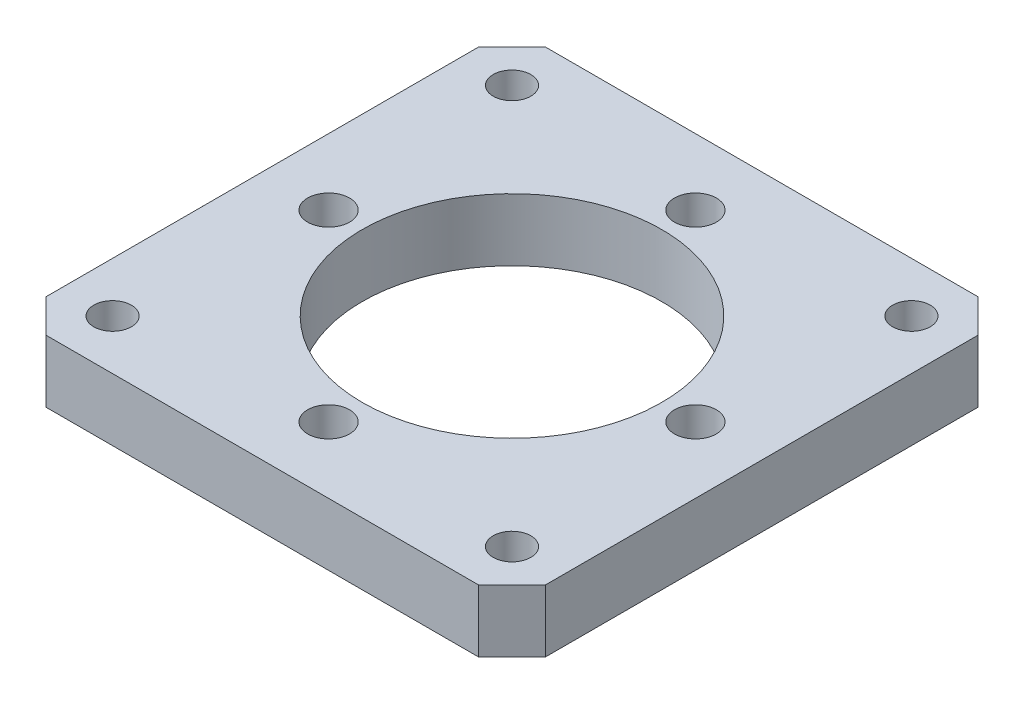
ISO-10303-21;
HEADER;
FILE_DESCRIPTION(('STEP AP214'),'2;1');
FILE_NAME('part.step','',(''),(''),'','','');
FILE_SCHEMA(('AUTOMOTIVE_DESIGN { 1 0 10303 214 1 1 1 1 }'));
ENDSEC;
DATA;
#1=APPLICATION_CONTEXT('core data for automotive mechanical design processes');
#2=APPLICATION_PROTOCOL_DEFINITION('international standard','automotive_design',2000,#1);
#3=PRODUCT_CONTEXT('',#1,'mechanical');
#4=PRODUCT('Part','Part','',(#3));
#5=PRODUCT_RELATED_PRODUCT_CATEGORY('part','',(#4));
#6=PRODUCT_DEFINITION_FORMATION('','',#4);
#7=PRODUCT_DEFINITION_CONTEXT('part definition',#1,'design');
#8=PRODUCT_DEFINITION('design','',#6,#7);
#9=PRODUCT_DEFINITION_SHAPE('','',#8);
#10=(LENGTH_UNIT() NAMED_UNIT(*) SI_UNIT(.MILLI.,.METRE.));
#11=(NAMED_UNIT(*) PLANE_ANGLE_UNIT() SI_UNIT($,.RADIAN.));
#12=(NAMED_UNIT(*) SI_UNIT($,.STERADIAN.) SOLID_ANGLE_UNIT());
#13=UNCERTAINTY_MEASURE_WITH_UNIT(LENGTH_MEASURE(1.E-05),#10,'distance_accuracy_value','');
#14=(GEOMETRIC_REPRESENTATION_CONTEXT(3) GLOBAL_UNCERTAINTY_ASSIGNED_CONTEXT((#13)) GLOBAL_UNIT_ASSIGNED_CONTEXT((#10,
#11,#12)) REPRESENTATION_CONTEXT('',''));
#15=CARTESIAN_POINT('',(0.,0.,0.));
#16=DIRECTION('',(0.,0.,1.));
#17=DIRECTION('',(1.,0.,0.));
#18=AXIS2_PLACEMENT_3D('',#15,#16,#17);
#19=CARTESIAN_POINT('',(0.,4.7625,0.));
#20=DIRECTION('',(0.,1.,0.));
#21=DIRECTION('',(0.,0.,1.));
#22=AXIS2_PLACEMENT_3D('',#19,#20,#21);
#23=PLANE('',#22);
#24=CARTESIAN_POINT('',(-15.2399999999998,4.7625,-15.2400000000002));
#25=DIRECTION('',(0.,1.,0.));
#26=DIRECTION('',(1.,0.,0.));
#27=AXIS2_PLACEMENT_3D('',#24,#25,#26);
#28=CIRCLE('',#27,1.4351);
#29=CARTESIAN_POINT('',(-13.8048999999998,4.7625,-15.2400000000001));
#30=VERTEX_POINT('',#29);
#31=EDGE_CURVE('E202',#30,#30,#28,.T.);
#32=ORIENTED_EDGE('',*,*,#31,.F.);
#33=EDGE_LOOP('',(#32));
#34=FACE_BOUND('',#33,.T.);
#35=CARTESIAN_POINT('',(-13.9954,4.7625,-1.46594033788936E-13));
#36=DIRECTION('',(0.,1.,0.));
#37=DIRECTION('',(1.,0.,0.));
#38=AXIS2_PLACEMENT_3D('',#35,#36,#37);
#39=CIRCLE('',#38,1.6002);
#40=CARTESIAN_POINT('',(-12.3952,4.7625,-1.29832828473685E-13));
#41=VERTEX_POINT('',#40);
#42=EDGE_CURVE('E208',#41,#41,#39,.T.);
#43=ORIENTED_EDGE('',*,*,#42,.F.);
#44=EDGE_LOOP('',(#43));
#45=FACE_BOUND('',#44,.T.);
#46=CARTESIAN_POINT('',(-15.24,4.7625,15.24));
#47=DIRECTION('',(0.,1.,0.));
#48=DIRECTION('',(0.,0.,-1.));
#49=AXIS2_PLACEMENT_3D('',#46,#47,#48);
#50=CIRCLE('',#49,1.4351);
#51=CARTESIAN_POINT('',(-15.24,4.7625,13.8049));
#52=VERTEX_POINT('',#51);
#53=EDGE_CURVE('E214',#52,#52,#50,.T.);
#54=ORIENTED_EDGE('',*,*,#53,.F.);
#55=EDGE_LOOP('',(#54));
#56=FACE_BOUND('',#55,.T.);
#57=CARTESIAN_POINT('',(0.,4.7625,13.9954));
#58=DIRECTION('',(0.,1.,0.));
#59=DIRECTION('',(0.,0.,-1.));
#60=AXIS2_PLACEMENT_3D('',#57,#58,#59);
#61=CIRCLE('',#60,1.6002);
#62=CARTESIAN_POINT('',(0.,4.7625,12.3952));
#63=VERTEX_POINT('',#62);
#64=EDGE_CURVE('E220',#63,#63,#61,.T.);
#65=ORIENTED_EDGE('',*,*,#64,.F.);
#66=EDGE_LOOP('',(#65));
#67=FACE_BOUND('',#66,.T.);
#68=CARTESIAN_POINT('',(15.2399999999999,4.7625,15.2400000000001));
#69=DIRECTION('',(0.,1.,0.));
#70=DIRECTION('',(-1.,0.,0.));
#71=AXIS2_PLACEMENT_3D('',#68,#69,#70);
#72=CIRCLE('',#71,1.4351);
#73=CARTESIAN_POINT('',(13.8048999999999,4.7625,15.24));
#74=VERTEX_POINT('',#73);
#75=EDGE_CURVE('E226',#74,#74,#72,.T.);
#76=ORIENTED_EDGE('',*,*,#75,.F.);
#77=EDGE_LOOP('',(#76));
#78=FACE_BOUND('',#77,.T.);
#79=CARTESIAN_POINT('',(13.9954,4.7625,0.));
#80=DIRECTION('',(0.,1.,0.));
#81=DIRECTION('',(-1.,0.,0.));
#82=AXIS2_PLACEMENT_3D('',#79,#80,#81);
#83=CIRCLE('',#82,1.6002);
#84=CARTESIAN_POINT('',(12.3952,4.7625,0.));
#85=VERTEX_POINT('',#84);
#86=EDGE_CURVE('E196',#85,#85,#83,.T.);
#87=ORIENTED_EDGE('',*,*,#86,.F.);
#88=EDGE_LOOP('',(#87));
#89=FACE_BOUND('',#88,.T.);
#90=CARTESIAN_POINT('',(0.,4.7625,-13.9954));
#91=DIRECTION('',(0.,1.,0.));
#92=DIRECTION('',(0.,0.,1.));
#93=AXIS2_PLACEMENT_3D('',#90,#91,#92);
#94=CIRCLE('',#93,1.6002);
#95=CARTESIAN_POINT('',(0.,4.7625,-12.3952));
#96=VERTEX_POINT('',#95);
#97=EDGE_CURVE('E191',#96,#96,#94,.T.);
#98=ORIENTED_EDGE('',*,*,#97,.F.);
#99=EDGE_LOOP('',(#98));
#100=FACE_BOUND('',#99,.T.);
#101=CARTESIAN_POINT('',(15.24,4.7625,-15.24));
#102=DIRECTION('',(0.,1.,0.));
#103=DIRECTION('',(0.,0.,1.));
#104=AXIS2_PLACEMENT_3D('',#101,#102,#103);
#105=CIRCLE('',#104,1.4351);
#106=CARTESIAN_POINT('',(15.24,4.7625,-13.8049));
#107=VERTEX_POINT('',#106);
#108=EDGE_CURVE('E184',#107,#107,#105,.T.);
#109=ORIENTED_EDGE('',*,*,#108,.F.);
#110=EDGE_LOOP('',(#109));
#111=FACE_BOUND('',#110,.T.);
#112=DIRECTION('',(0.,0.,1.));
#113=VECTOR('',#112,1.);
#114=CARTESIAN_POINT('',(-19.05,4.7625,-19.05));
#115=LINE('',#114,#113);
#116=CARTESIAN_POINT('',(-19.05,4.7625,-16.51));
#117=VERTEX_POINT('',#116);
#118=CARTESIAN_POINT('',(-19.05,4.7625,16.51));
#119=VERTEX_POINT('',#118);
#120=EDGE_CURVE('E177',#117,#119,#115,.T.);
#121=ORIENTED_EDGE('',*,*,#120,.T.);
#122=DIRECTION('',(-0.707106781186545,0.,-0.70710678118655));
#123=VECTOR('',#122,1.);
#124=CARTESIAN_POINT('',(-17.7800000000001,4.7625,17.7799999999999));
#125=LINE('',#124,#123);
#126=CARTESIAN_POINT('',(-16.51,4.7625,19.05));
#127=VERTEX_POINT('',#126);
#128=EDGE_CURVE('E154',#119,#127,#125,.F.);
#129=ORIENTED_EDGE('',*,*,#128,.T.);
#130=DIRECTION('',(1.,0.,0.));
#131=VECTOR('',#130,1.);
#132=CARTESIAN_POINT('',(-19.05,4.7625,19.05));
#133=LINE('',#132,#131);
#134=CARTESIAN_POINT('',(16.51,4.7625,19.05));
#135=VERTEX_POINT('',#134);
#136=EDGE_CURVE('E125',#127,#135,#133,.T.);
#137=ORIENTED_EDGE('',*,*,#136,.T.);
#138=DIRECTION('',(-0.70710678118655,0.,0.707106781186545));
#139=VECTOR('',#138,1.);
#140=CARTESIAN_POINT('',(17.7799999999999,4.7625,17.7800000000001));
#141=LINE('',#140,#139);
#142=CARTESIAN_POINT('',(19.05,4.7625,16.51));
#143=VERTEX_POINT('',#142);
#144=EDGE_CURVE('E152',#135,#143,#141,.F.);
#145=ORIENTED_EDGE('',*,*,#144,.T.);
#146=DIRECTION('',(0.,0.,-1.));
#147=VECTOR('',#146,1.);
#148=CARTESIAN_POINT('',(19.05,4.7625,-19.05));
#149=LINE('',#148,#147);
#150=CARTESIAN_POINT('',(19.05,4.7625,-16.51));
#151=VERTEX_POINT('',#150);
#152=EDGE_CURVE('E132',#143,#151,#149,.T.);
#153=ORIENTED_EDGE('',*,*,#152,.T.);
#154=DIRECTION('',(0.707106781186547,0.,0.707106781186548));
#155=VECTOR('',#154,1.);
#156=CARTESIAN_POINT('',(17.78,4.7625,-17.78));
#157=LINE('',#156,#155);
#158=CARTESIAN_POINT('',(16.51,4.7625,-19.05));
#159=VERTEX_POINT('',#158);
#160=EDGE_CURVE('E60',#151,#159,#157,.F.);
#161=ORIENTED_EDGE('',*,*,#160,.T.);
#162=DIRECTION('',(-1.,0.,0.));
#163=VECTOR('',#162,1.);
#164=CARTESIAN_POINT('',(-19.05,4.7625,-19.05));
#165=LINE('',#164,#163);
#166=CARTESIAN_POINT('',(-16.51,4.7625,-19.05));
#167=VERTEX_POINT('',#166);
#168=EDGE_CURVE('E135',#159,#167,#165,.T.);
#169=ORIENTED_EDGE('',*,*,#168,.T.);
#170=DIRECTION('',(0.707106781186549,0.,-0.707106781186546));
#171=VECTOR('',#170,1.);
#172=CARTESIAN_POINT('',(-17.7799999999999,4.7625,-17.78));
#173=LINE('',#172,#171);
#174=EDGE_CURVE('E149',#167,#117,#173,.F.);
#175=ORIENTED_EDGE('',*,*,#174,.T.);
#176=EDGE_LOOP('',(#121,#129,#137,#145,#153,#161,#169,#175));
#177=FACE_BOUND('',#176,.T.);
#178=CARTESIAN_POINT('',(0.,4.7625,0.));
#179=DIRECTION('',(0.,1.,0.));
#180=DIRECTION('',(0.,0.,1.));
#181=AXIS2_PLACEMENT_3D('',#178,#179,#180);
#182=CIRCLE('',#181,11.43);
#183=CARTESIAN_POINT('',(0.,4.7625,11.43));
#184=VERTEX_POINT('',#183);
#185=EDGE_CURVE('E170',#184,#184,#182,.T.);
#186=ORIENTED_EDGE('',*,*,#185,.F.);
#187=EDGE_LOOP('',(#186));
#188=FACE_BOUND('',#187,.T.);
#189=ADVANCED_FACE('F38',(#34,#45,#56,#67,#78,#89,#100,#111,#177,#188),#23,.T.);
#190=CARTESIAN_POINT('',(0.,0.,0.));
#191=DIRECTION('',(0.,1.,0.));
#192=DIRECTION('',(0.,0.,1.));
#193=AXIS2_PLACEMENT_3D('',#190,#191,#192);
#194=PLANE('',#193);
#195=CARTESIAN_POINT('',(-15.2399999999998,0.,-15.2400000000002));
#196=DIRECTION('',(0.,1.,0.));
#197=DIRECTION('',(1.,0.,0.));
#198=AXIS2_PLACEMENT_3D('',#195,#196,#197);
#199=CIRCLE('',#198,1.4351);
#200=CARTESIAN_POINT('',(-13.8048999999998,0.,-15.2400000000001));
#201=VERTEX_POINT('',#200);
#202=EDGE_CURVE('E205',#201,#201,#199,.T.);
#203=ORIENTED_EDGE('',*,*,#202,.T.);
#204=EDGE_LOOP('',(#203));
#205=FACE_BOUND('',#204,.T.);
#206=CARTESIAN_POINT('',(-13.9954,0.,-1.46594033788936E-13));
#207=DIRECTION('',(0.,1.,0.));
#208=DIRECTION('',(1.,0.,0.));
#209=AXIS2_PLACEMENT_3D('',#206,#207,#208);
#210=CIRCLE('',#209,1.6002);
#211=CARTESIAN_POINT('',(-12.3952,0.,-1.29832828473685E-13));
#212=VERTEX_POINT('',#211);
#213=EDGE_CURVE('E211',#212,#212,#210,.T.);
#214=ORIENTED_EDGE('',*,*,#213,.T.);
#215=EDGE_LOOP('',(#214));
#216=FACE_BOUND('',#215,.T.);
#217=CARTESIAN_POINT('',(-15.24,0.,15.24));
#218=DIRECTION('',(0.,1.,0.));
#219=DIRECTION('',(0.,0.,-1.));
#220=AXIS2_PLACEMENT_3D('',#217,#218,#219);
#221=CIRCLE('',#220,1.4351);
#222=CARTESIAN_POINT('',(-15.24,0.,13.8049));
#223=VERTEX_POINT('',#222);
#224=EDGE_CURVE('E217',#223,#223,#221,.T.);
#225=ORIENTED_EDGE('',*,*,#224,.T.);
#226=EDGE_LOOP('',(#225));
#227=FACE_BOUND('',#226,.T.);
#228=CARTESIAN_POINT('',(0.,0.,13.9954));
#229=DIRECTION('',(0.,1.,0.));
#230=DIRECTION('',(0.,0.,-1.));
#231=AXIS2_PLACEMENT_3D('',#228,#229,#230);
#232=CIRCLE('',#231,1.6002);
#233=CARTESIAN_POINT('',(0.,0.,12.3952));
#234=VERTEX_POINT('',#233);
#235=EDGE_CURVE('E223',#234,#234,#232,.T.);
#236=ORIENTED_EDGE('',*,*,#235,.T.);
#237=EDGE_LOOP('',(#236));
#238=FACE_BOUND('',#237,.T.);
#239=CARTESIAN_POINT('',(15.2399999999999,0.,15.2400000000001));
#240=DIRECTION('',(0.,1.,0.));
#241=DIRECTION('',(-1.,0.,0.));
#242=AXIS2_PLACEMENT_3D('',#239,#240,#241);
#243=CIRCLE('',#242,1.4351);
#244=CARTESIAN_POINT('',(13.8048999999999,0.,15.24));
#245=VERTEX_POINT('',#244);
#246=EDGE_CURVE('E199',#245,#245,#243,.T.);
#247=ORIENTED_EDGE('',*,*,#246,.T.);
#248=EDGE_LOOP('',(#247));
#249=FACE_BOUND('',#248,.T.);
#250=CARTESIAN_POINT('',(13.9954,0.,0.));
#251=DIRECTION('',(0.,1.,0.));
#252=DIRECTION('',(-1.,0.,0.));
#253=AXIS2_PLACEMENT_3D('',#250,#251,#252);
#254=CIRCLE('',#253,1.6002);
#255=CARTESIAN_POINT('',(12.3952,0.,0.));
#256=VERTEX_POINT('',#255);
#257=EDGE_CURVE('E188',#256,#256,#254,.T.);
#258=ORIENTED_EDGE('',*,*,#257,.T.);
#259=EDGE_LOOP('',(#258));
#260=FACE_BOUND('',#259,.T.);
#261=CARTESIAN_POINT('',(0.,0.,-13.9954));
#262=DIRECTION('',(0.,1.,0.));
#263=DIRECTION('',(0.,0.,1.));
#264=AXIS2_PLACEMENT_3D('',#261,#262,#263);
#265=CIRCLE('',#264,1.6002);
#266=CARTESIAN_POINT('',(0.,0.,-12.3952));
#267=VERTEX_POINT('',#266);
#268=EDGE_CURVE('E182',#267,#267,#265,.T.);
#269=ORIENTED_EDGE('',*,*,#268,.T.);
#270=EDGE_LOOP('',(#269));
#271=FACE_BOUND('',#270,.T.);
#272=CARTESIAN_POINT('',(15.24,0.,-15.24));
#273=DIRECTION('',(0.,1.,0.));
#274=DIRECTION('',(0.,0.,1.));
#275=AXIS2_PLACEMENT_3D('',#272,#273,#274);
#276=CIRCLE('',#275,1.4351);
#277=CARTESIAN_POINT('',(15.24,0.,-13.8049));
#278=VERTEX_POINT('',#277);
#279=EDGE_CURVE('E187',#278,#278,#276,.T.);
#280=ORIENTED_EDGE('',*,*,#279,.T.);
#281=EDGE_LOOP('',(#280));
#282=FACE_BOUND('',#281,.T.);
#283=DIRECTION('',(1.,0.,0.));
#284=VECTOR('',#283,1.);
#285=CARTESIAN_POINT('',(-19.05,0.,19.05));
#286=LINE('',#285,#284);
#287=CARTESIAN_POINT('',(-16.51,0.,19.05));
#288=VERTEX_POINT('',#287);
#289=CARTESIAN_POINT('',(16.51,0.,19.05));
#290=VERTEX_POINT('',#289);
#291=EDGE_CURVE('E122',#288,#290,#286,.T.);
#292=ORIENTED_EDGE('',*,*,#291,.F.);
#293=DIRECTION('',(0.707106781186545,0.,0.70710678118655));
#294=VECTOR('',#293,1.);
#295=CARTESIAN_POINT('',(-16.51,0.,19.05));
#296=LINE('',#295,#294);
#297=CARTESIAN_POINT('',(-19.05,0.,16.51));
#298=VERTEX_POINT('',#297);
#299=EDGE_CURVE('E105',#288,#298,#296,.F.);
#300=ORIENTED_EDGE('',*,*,#299,.T.);
#301=DIRECTION('',(0.,0.,1.));
#302=VECTOR('',#301,1.);
#303=CARTESIAN_POINT('',(-19.05,0.,-19.05));
#304=LINE('',#303,#302);
#305=CARTESIAN_POINT('',(-19.05,0.,-16.51));
#306=VERTEX_POINT('',#305);
#307=EDGE_CURVE('E133',#306,#298,#304,.T.);
#308=ORIENTED_EDGE('',*,*,#307,.F.);
#309=DIRECTION('',(-0.707106781186549,0.,0.707106781186546));
#310=VECTOR('',#309,1.);
#311=CARTESIAN_POINT('',(-19.05,0.,-16.51));
#312=LINE('',#311,#310);
#313=CARTESIAN_POINT('',(-16.51,0.,-19.05));
#314=VERTEX_POINT('',#313);
#315=EDGE_CURVE('E126',#306,#314,#312,.F.);
#316=ORIENTED_EDGE('',*,*,#315,.T.);
#317=DIRECTION('',(-1.,0.,0.));
#318=VECTOR('',#317,1.);
#319=CARTESIAN_POINT('',(-19.05,0.,-19.05));
#320=LINE('',#319,#318);
#321=CARTESIAN_POINT('',(16.51,0.,-19.05));
#322=VERTEX_POINT('',#321);
#323=EDGE_CURVE('E137',#322,#314,#320,.T.);
#324=ORIENTED_EDGE('',*,*,#323,.F.);
#325=DIRECTION('',(-0.707106781186547,0.,-0.707106781186548));
#326=VECTOR('',#325,1.);
#327=CARTESIAN_POINT('',(16.51,0.,-19.05));
#328=LINE('',#327,#326);
#329=CARTESIAN_POINT('',(19.05,0.,-16.51));
#330=VERTEX_POINT('',#329);
#331=EDGE_CURVE('E143',#322,#330,#328,.F.);
#332=ORIENTED_EDGE('',*,*,#331,.T.);
#333=DIRECTION('',(0.,0.,-1.));
#334=VECTOR('',#333,1.);
#335=CARTESIAN_POINT('',(19.05,0.,-19.05));
#336=LINE('',#335,#334);
#337=CARTESIAN_POINT('',(19.05,0.,16.51));
#338=VERTEX_POINT('',#337);
#339=EDGE_CURVE('E165',#338,#330,#336,.T.);
#340=ORIENTED_EDGE('',*,*,#339,.F.);
#341=DIRECTION('',(0.70710678118655,0.,-0.707106781186545));
#342=VECTOR('',#341,1.);
#343=CARTESIAN_POINT('',(19.05,0.,16.51));
#344=LINE('',#343,#342);
#345=EDGE_CURVE('E116',#338,#290,#344,.F.);
#346=ORIENTED_EDGE('',*,*,#345,.T.);
#347=EDGE_LOOP('',(#292,#300,#308,#316,#324,#332,#340,#346));
#348=FACE_BOUND('',#347,.T.);
#349=CARTESIAN_POINT('',(0.,0.,0.));
#350=DIRECTION('',(0.,1.,0.));
#351=DIRECTION('',(0.,0.,1.));
#352=AXIS2_PLACEMENT_3D('',#349,#350,#351);
#353=CIRCLE('',#352,11.43);
#354=CARTESIAN_POINT('',(0.,0.,11.43));
#355=VERTEX_POINT('',#354);
#356=EDGE_CURVE('E173',#355,#355,#353,.T.);
#357=ORIENTED_EDGE('',*,*,#356,.T.);
#358=EDGE_LOOP('',(#357));
#359=FACE_BOUND('',#358,.T.);
#360=ADVANCED_FACE('F129',(#205,#216,#227,#238,#249,#260,#271,#282,#348,#359),#194,.F.);
#361=CARTESIAN_POINT('',(19.05,4.7625,-19.05));
#362=DIRECTION('',(-1.,0.,0.));
#363=DIRECTION('',(0.,0.,1.));
#364=AXIS2_PLACEMENT_3D('',#361,#362,#363);
#365=PLANE('',#364);
#366=ORIENTED_EDGE('',*,*,#152,.F.);
#367=DIRECTION('',(0.,-1.,0.));
#368=VECTOR('',#367,1.);
#369=CARTESIAN_POINT('',(19.05,4.7625,16.51));
#370=LINE('',#369,#368);
#371=EDGE_CURVE('E158',#143,#338,#370,.T.);
#372=ORIENTED_EDGE('',*,*,#371,.T.);
#373=ORIENTED_EDGE('',*,*,#339,.T.);
#374=DIRECTION('',(0.,1.,0.));
#375=VECTOR('',#374,1.);
#376=CARTESIAN_POINT('',(19.05,4.7625,-16.51));
#377=LINE('',#376,#375);
#378=EDGE_CURVE('E156',#330,#151,#377,.T.);
#379=ORIENTED_EDGE('',*,*,#378,.T.);
#380=EDGE_LOOP('',(#366,#372,#373,#379));
#381=FACE_BOUND('',#380,.T.);
#382=ADVANCED_FACE('F164',(#381),#365,.F.);
#383=CARTESIAN_POINT('',(-19.05,4.7625,-19.05));
#384=DIRECTION('',(0.,0.,1.));
#385=DIRECTION('',(1.,0.,0.));
#386=AXIS2_PLACEMENT_3D('',#383,#384,#385);
#387=PLANE('',#386);
#388=ORIENTED_EDGE('',*,*,#168,.F.);
#389=DIRECTION('',(0.,-1.,0.));
#390=VECTOR('',#389,1.);
#391=CARTESIAN_POINT('',(16.51,4.7625,-19.05));
#392=LINE('',#391,#390);
#393=EDGE_CURVE('E11',#159,#322,#392,.T.);
#394=ORIENTED_EDGE('',*,*,#393,.T.);
#395=ORIENTED_EDGE('',*,*,#323,.T.);
#396=DIRECTION('',(0.,1.,0.));
#397=VECTOR('',#396,1.);
#398=CARTESIAN_POINT('',(-16.51,4.7625,-19.05));
#399=LINE('',#398,#397);
#400=EDGE_CURVE('E47',#314,#167,#399,.T.);
#401=ORIENTED_EDGE('',*,*,#400,.T.);
#402=EDGE_LOOP('',(#388,#394,#395,#401));
#403=FACE_BOUND('',#402,.T.);
#404=ADVANCED_FACE('F267',(#403),#387,.F.);
#405=CARTESIAN_POINT('',(-19.05,4.7625,-19.05));
#406=DIRECTION('',(1.,0.,0.));
#407=DIRECTION('',(0.,0.,-1.));
#408=AXIS2_PLACEMENT_3D('',#405,#406,#407);
#409=PLANE('',#408);
#410=ORIENTED_EDGE('',*,*,#307,.T.);
#411=DIRECTION('',(0.,1.,0.));
#412=VECTOR('',#411,1.);
#413=CARTESIAN_POINT('',(-19.05,4.7625,16.51));
#414=LINE('',#413,#412);
#415=EDGE_CURVE('E110',#298,#119,#414,.T.);
#416=ORIENTED_EDGE('',*,*,#415,.T.);
#417=ORIENTED_EDGE('',*,*,#120,.F.);
#418=DIRECTION('',(0.,-1.,0.));
#419=VECTOR('',#418,1.);
#420=CARTESIAN_POINT('',(-19.05,4.7625,-16.51));
#421=LINE('',#420,#419);
#422=EDGE_CURVE('E115',#117,#306,#421,.T.);
#423=ORIENTED_EDGE('',*,*,#422,.T.);
#424=EDGE_LOOP('',(#410,#416,#417,#423));
#425=FACE_BOUND('',#424,.T.);
#426=ADVANCED_FACE('F273',(#425),#409,.F.);
#427=CARTESIAN_POINT('',(-19.05,4.7625,19.05));
#428=DIRECTION('',(0.,0.,-1.));
#429=DIRECTION('',(-1.,0.,0.));
#430=AXIS2_PLACEMENT_3D('',#427,#428,#429);
#431=PLANE('',#430);
#432=ORIENTED_EDGE('',*,*,#136,.F.);
#433=DIRECTION('',(0.,-1.,0.));
#434=VECTOR('',#433,1.);
#435=CARTESIAN_POINT('',(-16.51,4.7625,19.05));
#436=LINE('',#435,#434);
#437=EDGE_CURVE('E109',#127,#288,#436,.T.);
#438=ORIENTED_EDGE('',*,*,#437,.T.);
#439=ORIENTED_EDGE('',*,*,#291,.T.);
#440=DIRECTION('',(0.,1.,0.));
#441=VECTOR('',#440,1.);
#442=CARTESIAN_POINT('',(16.51,4.7625,19.05));
#443=LINE('',#442,#441);
#444=EDGE_CURVE('E127',#290,#135,#443,.T.);
#445=ORIENTED_EDGE('',*,*,#444,.T.);
#446=EDGE_LOOP('',(#432,#438,#439,#445));
#447=FACE_BOUND('',#446,.T.);
#448=ADVANCED_FACE('F121',(#447),#431,.F.);
#449=CARTESIAN_POINT('',(0.,4.7625,0.));
#450=DIRECTION('',(0.,-1.,0.));
#451=DIRECTION('',(0.,0.,-1.));
#452=AXIS2_PLACEMENT_3D('',#449,#450,#451);
#453=CYLINDRICAL_SURFACE('',#452,11.43);
#454=ORIENTED_EDGE('',*,*,#185,.T.);
#455=EDGE_LOOP('',(#454));
#456=FACE_BOUND('',#455,.T.);
#457=ORIENTED_EDGE('',*,*,#356,.F.);
#458=EDGE_LOOP('',(#457));
#459=FACE_BOUND('',#458,.T.);
#460=ADVANCED_FACE('F255',(#456,#459),#453,.F.);
#461=CARTESIAN_POINT('',(15.24,0.,-15.24));
#462=DIRECTION('',(0.,1.,0.));
#463=DIRECTION('',(0.,0.,1.));
#464=AXIS2_PLACEMENT_3D('',#461,#462,#463);
#465=CYLINDRICAL_SURFACE('',#464,1.4351);
#466=ORIENTED_EDGE('',*,*,#279,.F.);
#467=EDGE_LOOP('',(#466));
#468=FACE_BOUND('',#467,.T.);
#469=ORIENTED_EDGE('',*,*,#108,.T.);
#470=EDGE_LOOP('',(#469));
#471=FACE_BOUND('',#470,.T.);
#472=ADVANCED_FACE('F258',(#468,#471),#465,.F.);
#473=CARTESIAN_POINT('',(0.,0.,-13.9954));
#474=DIRECTION('',(0.,1.,0.));
#475=DIRECTION('',(0.,0.,1.));
#476=AXIS2_PLACEMENT_3D('',#473,#474,#475);
#477=CYLINDRICAL_SURFACE('',#476,1.6002);
#478=ORIENTED_EDGE('',*,*,#268,.F.);
#479=EDGE_LOOP('',(#478));
#480=FACE_BOUND('',#479,.T.);
#481=ORIENTED_EDGE('',*,*,#97,.T.);
#482=EDGE_LOOP('',(#481));
#483=FACE_BOUND('',#482,.T.);
#484=ADVANCED_FACE('F409',(#480,#483),#477,.F.);
#485=CARTESIAN_POINT('',(13.9954,0.,0.));
#486=DIRECTION('',(0.,1.,0.));
#487=DIRECTION('',(0.,0.,1.));
#488=AXIS2_PLACEMENT_3D('',#485,#486,#487);
#489=CYLINDRICAL_SURFACE('',#488,1.6002);
#490=ORIENTED_EDGE('',*,*,#257,.F.);
#491=EDGE_LOOP('',(#490));
#492=FACE_BOUND('',#491,.T.);
#493=ORIENTED_EDGE('',*,*,#86,.T.);
#494=EDGE_LOOP('',(#493));
#495=FACE_BOUND('',#494,.T.);
#496=ADVANCED_FACE('F238',(#492,#495),#489,.F.);
#497=CARTESIAN_POINT('',(15.2399999999999,0.,15.2400000000001));
#498=DIRECTION('',(0.,1.,0.));
#499=DIRECTION('',(0.,0.,1.));
#500=AXIS2_PLACEMENT_3D('',#497,#498,#499);
#501=CYLINDRICAL_SURFACE('',#500,1.4351);
#502=ORIENTED_EDGE('',*,*,#246,.F.);
#503=EDGE_LOOP('',(#502));
#504=FACE_BOUND('',#503,.T.);
#505=ORIENTED_EDGE('',*,*,#75,.T.);
#506=EDGE_LOOP('',(#505));
#507=FACE_BOUND('',#506,.T.);
#508=ADVANCED_FACE('F234',(#504,#507),#501,.F.);
#509=CARTESIAN_POINT('',(0.,0.,13.9954));
#510=DIRECTION('',(0.,1.,0.));
#511=DIRECTION('',(0.,0.,1.));
#512=AXIS2_PLACEMENT_3D('',#509,#510,#511);
#513=CYLINDRICAL_SURFACE('',#512,1.6002);
#514=ORIENTED_EDGE('',*,*,#235,.F.);
#515=EDGE_LOOP('',(#514));
#516=FACE_BOUND('',#515,.T.);
#517=ORIENTED_EDGE('',*,*,#64,.T.);
#518=EDGE_LOOP('',(#517));
#519=FACE_BOUND('',#518,.T.);
#520=ADVANCED_FACE('F237',(#516,#519),#513,.F.);
#521=CARTESIAN_POINT('',(-15.24,0.,15.24));
#522=DIRECTION('',(0.,1.,0.));
#523=DIRECTION('',(0.,0.,1.));
#524=AXIS2_PLACEMENT_3D('',#521,#522,#523);
#525=CYLINDRICAL_SURFACE('',#524,1.4351);
#526=ORIENTED_EDGE('',*,*,#224,.F.);
#527=EDGE_LOOP('',(#526));
#528=FACE_BOUND('',#527,.T.);
#529=ORIENTED_EDGE('',*,*,#53,.T.);
#530=EDGE_LOOP('',(#529));
#531=FACE_BOUND('',#530,.T.);
#532=ADVANCED_FACE('F375',(#528,#531),#525,.F.);
#533=CARTESIAN_POINT('',(-13.9954,0.,-1.46594033788936E-13));
#534=DIRECTION('',(0.,1.,0.));
#535=DIRECTION('',(0.,0.,1.));
#536=AXIS2_PLACEMENT_3D('',#533,#534,#535);
#537=CYLINDRICAL_SURFACE('',#536,1.6002);
#538=ORIENTED_EDGE('',*,*,#213,.F.);
#539=EDGE_LOOP('',(#538));
#540=FACE_BOUND('',#539,.T.);
#541=ORIENTED_EDGE('',*,*,#42,.T.);
#542=EDGE_LOOP('',(#541));
#543=FACE_BOUND('',#542,.T.);
#544=ADVANCED_FACE('F365',(#540,#543),#537,.F.);
#545=CARTESIAN_POINT('',(-15.2399999999998,0.,-15.2400000000002));
#546=DIRECTION('',(0.,1.,0.));
#547=DIRECTION('',(0.,0.,1.));
#548=AXIS2_PLACEMENT_3D('',#545,#546,#547);
#549=CYLINDRICAL_SURFACE('',#548,1.4351);
#550=ORIENTED_EDGE('',*,*,#202,.F.);
#551=EDGE_LOOP('',(#550));
#552=FACE_BOUND('',#551,.T.);
#553=ORIENTED_EDGE('',*,*,#31,.T.);
#554=EDGE_LOOP('',(#553));
#555=FACE_BOUND('',#554,.T.);
#556=ADVANCED_FACE('F286',(#552,#555),#549,.F.);
#557=CARTESIAN_POINT('',(-16.51,4.7625,19.05));
#558=DIRECTION('',(0.70710678118655,0.,-0.707106781186545));
#559=DIRECTION('',(0.,-1.,0.));
#560=AXIS2_PLACEMENT_3D('',#557,#558,#559);
#561=PLANE('',#560);
#562=ORIENTED_EDGE('',*,*,#128,.F.);
#563=ORIENTED_EDGE('',*,*,#415,.F.);
#564=ORIENTED_EDGE('',*,*,#299,.F.);
#565=ORIENTED_EDGE('',*,*,#437,.F.);
#566=EDGE_LOOP('',(#562,#563,#564,#565));
#567=FACE_BOUND('',#566,.T.);
#568=ADVANCED_FACE('F108',(#567),#561,.F.);
#569=CARTESIAN_POINT('',(19.05,4.7625,16.51));
#570=DIRECTION('',(-0.707106781186545,0.,-0.70710678118655));
#571=DIRECTION('',(0.,-1.,0.));
#572=AXIS2_PLACEMENT_3D('',#569,#570,#571);
#573=PLANE('',#572);
#574=ORIENTED_EDGE('',*,*,#144,.F.);
#575=ORIENTED_EDGE('',*,*,#444,.F.);
#576=ORIENTED_EDGE('',*,*,#345,.F.);
#577=ORIENTED_EDGE('',*,*,#371,.F.);
#578=EDGE_LOOP('',(#574,#575,#576,#577));
#579=FACE_BOUND('',#578,.T.);
#580=ADVANCED_FACE('F285',(#579),#573,.F.);
#581=CARTESIAN_POINT('',(16.51,4.7625,-19.05));
#582=DIRECTION('',(-0.707106781186548,0.,0.707106781186547));
#583=DIRECTION('',(0.,-1.,0.));
#584=AXIS2_PLACEMENT_3D('',#581,#582,#583);
#585=PLANE('',#584);
#586=ORIENTED_EDGE('',*,*,#160,.F.);
#587=ORIENTED_EDGE('',*,*,#378,.F.);
#588=ORIENTED_EDGE('',*,*,#331,.F.);
#589=ORIENTED_EDGE('',*,*,#393,.F.);
#590=EDGE_LOOP('',(#586,#587,#588,#589));
#591=FACE_BOUND('',#590,.T.);
#592=ADVANCED_FACE('F291',(#591),#585,.F.);
#593=CARTESIAN_POINT('',(-19.05,4.7625,-16.51));
#594=DIRECTION('',(0.707106781186546,0.,0.707106781186549));
#595=DIRECTION('',(0.,-1.,0.));
#596=AXIS2_PLACEMENT_3D('',#593,#594,#595);
#597=PLANE('',#596);
#598=ORIENTED_EDGE('',*,*,#174,.F.);
#599=ORIENTED_EDGE('',*,*,#400,.F.);
#600=ORIENTED_EDGE('',*,*,#315,.F.);
#601=ORIENTED_EDGE('',*,*,#422,.F.);
#602=EDGE_LOOP('',(#598,#599,#600,#601));
#603=FACE_BOUND('',#602,.T.);
#604=ADVANCED_FACE('F41',(#603),#597,.F.);
#605=CLOSED_SHELL('',(#189,#360,#382,#404,#426,#448,#460,#472,#484,#496,#508,#520,#532,#544,
#556,#568,#580,#592,#604));
#606=MANIFOLD_SOLID_BREP('B2',#605);
#607=ADVANCED_BREP_SHAPE_REPRESENTATION('',(#18,#606),#14);
#608=SHAPE_DEFINITION_REPRESENTATION(#9,#607);
ENDSEC;
END-ISO-10303-21;
